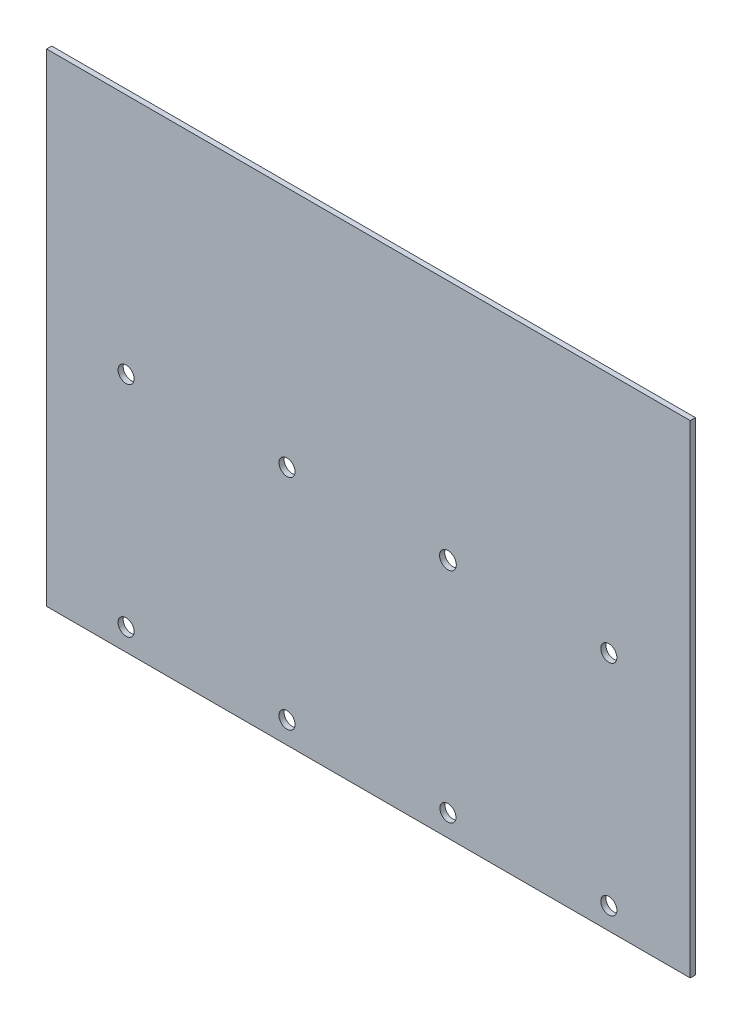
ISO-10303-21;
HEADER;
FILE_DESCRIPTION(('STEP AP214'),'2;1');
FILE_NAME('part.step','',(''),(''),'','','');
FILE_SCHEMA(('AUTOMOTIVE_DESIGN { 1 0 10303 214 1 1 1 1 }'));
ENDSEC;
DATA;
#1=APPLICATION_CONTEXT('core data for automotive mechanical design processes');
#2=APPLICATION_PROTOCOL_DEFINITION('international standard','automotive_design',2000,#1);
#3=PRODUCT_CONTEXT('',#1,'mechanical');
#4=PRODUCT('Part','Part','',(#3));
#5=PRODUCT_RELATED_PRODUCT_CATEGORY('part','',(#4));
#6=PRODUCT_DEFINITION_FORMATION('','',#4);
#7=PRODUCT_DEFINITION_CONTEXT('part definition',#1,'design');
#8=PRODUCT_DEFINITION('design','',#6,#7);
#9=PRODUCT_DEFINITION_SHAPE('','',#8);
#10=(LENGTH_UNIT() NAMED_UNIT(*) SI_UNIT(.MILLI.,.METRE.));
#11=(NAMED_UNIT(*) PLANE_ANGLE_UNIT() SI_UNIT($,.RADIAN.));
#12=(NAMED_UNIT(*) SI_UNIT($,.STERADIAN.) SOLID_ANGLE_UNIT());
#13=UNCERTAINTY_MEASURE_WITH_UNIT(LENGTH_MEASURE(1.E-05),#10,'distance_accuracy_value','');
#14=(GEOMETRIC_REPRESENTATION_CONTEXT(3) GLOBAL_UNCERTAINTY_ASSIGNED_CONTEXT((#13)) GLOBAL_UNIT_ASSIGNED_CONTEXT((#10,
#11,#12)) REPRESENTATION_CONTEXT('',''));
#15=CARTESIAN_POINT('',(0.,0.,0.));
#16=DIRECTION('',(0.,0.,1.));
#17=DIRECTION('',(1.,0.,0.));
#18=AXIS2_PLACEMENT_3D('',#15,#16,#17);
#19=CARTESIAN_POINT('',(100.,-75.,1.6));
#20=DIRECTION('',(-1.,0.,0.));
#21=DIRECTION('',(0.,0.,1.));
#22=AXIS2_PLACEMENT_3D('',#19,#20,#21);
#23=PLANE('',#22);
#24=DIRECTION('',(0.,1.,0.));
#25=VECTOR('',#24,1.);
#26=CARTESIAN_POINT('',(100.,-75.,0.));
#27=LINE('',#26,#25);
#28=CARTESIAN_POINT('',(100.,-75.,0.));
#29=VERTEX_POINT('',#28);
#30=CARTESIAN_POINT('',(100.,75.,0.));
#31=VERTEX_POINT('',#30);
#32=EDGE_CURVE('E96',#29,#31,#27,.T.);
#33=ORIENTED_EDGE('',*,*,#32,.T.);
#34=DIRECTION('',(0.,0.,-1.));
#35=VECTOR('',#34,1.);
#36=CARTESIAN_POINT('',(100.,75.,1.6));
#37=LINE('',#36,#35);
#38=CARTESIAN_POINT('',(100.,75.,1.6));
#39=VERTEX_POINT('',#38);
#40=EDGE_CURVE('E11',#39,#31,#37,.T.);
#41=ORIENTED_EDGE('',*,*,#40,.F.);
#42=DIRECTION('',(0.,1.,0.));
#43=VECTOR('',#42,1.);
#44=CARTESIAN_POINT('',(100.,-75.,1.6));
#45=LINE('',#44,#43);
#46=CARTESIAN_POINT('',(100.,-75.,1.6));
#47=VERTEX_POINT('',#46);
#48=EDGE_CURVE('E84',#47,#39,#45,.T.);
#49=ORIENTED_EDGE('',*,*,#48,.F.);
#50=DIRECTION('',(0.,0.,-1.));
#51=VECTOR('',#50,1.);
#52=CARTESIAN_POINT('',(100.,-75.,1.6));
#53=LINE('',#52,#51);
#54=EDGE_CURVE('E92',#47,#29,#53,.T.);
#55=ORIENTED_EDGE('',*,*,#54,.T.);
#56=EDGE_LOOP('',(#33,#41,#49,#55));
#57=FACE_BOUND('',#56,.T.);
#58=ADVANCED_FACE('F33',(#57),#23,.F.);
#59=CARTESIAN_POINT('',(-100.,75.,1.6));
#60=DIRECTION('',(0.,-1.,0.));
#61=DIRECTION('',(0.,0.,-1.));
#62=AXIS2_PLACEMENT_3D('',#59,#60,#61);
#63=PLANE('',#62);
#64=DIRECTION('',(-1.,0.,0.));
#65=VECTOR('',#64,1.);
#66=CARTESIAN_POINT('',(-100.,75.,0.));
#67=LINE('',#66,#65);
#68=CARTESIAN_POINT('',(-100.,75.,0.));
#69=VERTEX_POINT('',#68);
#70=EDGE_CURVE('E88',#31,#69,#67,.T.);
#71=ORIENTED_EDGE('',*,*,#70,.T.);
#72=DIRECTION('',(0.,0.,-1.));
#73=VECTOR('',#72,1.);
#74=CARTESIAN_POINT('',(-100.,75.,1.6));
#75=LINE('',#74,#73);
#76=CARTESIAN_POINT('',(-100.,75.,1.6));
#77=VERTEX_POINT('',#76);
#78=EDGE_CURVE('E41',#77,#69,#75,.T.);
#79=ORIENTED_EDGE('',*,*,#78,.F.);
#80=DIRECTION('',(-1.,0.,0.));
#81=VECTOR('',#80,1.);
#82=CARTESIAN_POINT('',(-100.,75.,1.6));
#83=LINE('',#82,#81);
#84=EDGE_CURVE('E79',#39,#77,#83,.T.);
#85=ORIENTED_EDGE('',*,*,#84,.F.);
#86=ORIENTED_EDGE('',*,*,#40,.T.);
#87=EDGE_LOOP('',(#71,#79,#85,#86));
#88=FACE_BOUND('',#87,.T.);
#89=ADVANCED_FACE('F87',(#88),#63,.F.);
#90=CARTESIAN_POINT('',(-100.,-75.,1.6));
#91=DIRECTION('',(1.,0.,0.));
#92=DIRECTION('',(0.,0.,-1.));
#93=AXIS2_PLACEMENT_3D('',#90,#91,#92);
#94=PLANE('',#93);
#95=DIRECTION('',(0.,-1.,0.));
#96=VECTOR('',#95,1.);
#97=CARTESIAN_POINT('',(-100.,-75.,0.));
#98=LINE('',#97,#96);
#99=CARTESIAN_POINT('',(-100.,-75.,0.));
#100=VERTEX_POINT('',#99);
#101=EDGE_CURVE('E66',#69,#100,#98,.T.);
#102=ORIENTED_EDGE('',*,*,#101,.T.);
#103=DIRECTION('',(0.,0.,-1.));
#104=VECTOR('',#103,1.);
#105=CARTESIAN_POINT('',(-100.,-75.,1.6));
#106=LINE('',#105,#104);
#107=CARTESIAN_POINT('',(-100.,-75.,1.6));
#108=VERTEX_POINT('',#107);
#109=EDGE_CURVE('E89',#108,#100,#106,.T.);
#110=ORIENTED_EDGE('',*,*,#109,.F.);
#111=DIRECTION('',(0.,-1.,0.));
#112=VECTOR('',#111,1.);
#113=CARTESIAN_POINT('',(-100.,-75.,1.6));
#114=LINE('',#113,#112);
#115=EDGE_CURVE('E82',#77,#108,#114,.T.);
#116=ORIENTED_EDGE('',*,*,#115,.F.);
#117=ORIENTED_EDGE('',*,*,#78,.T.);
#118=EDGE_LOOP('',(#102,#110,#116,#117));
#119=FACE_BOUND('',#118,.T.);
#120=ADVANCED_FACE('F90',(#119),#94,.F.);
#121=CARTESIAN_POINT('',(-100.,-75.,1.6));
#122=DIRECTION('',(0.,1.,0.));
#123=DIRECTION('',(0.,0.,1.));
#124=AXIS2_PLACEMENT_3D('',#121,#122,#123);
#125=PLANE('',#124);
#126=DIRECTION('',(1.,0.,0.));
#127=VECTOR('',#126,1.);
#128=CARTESIAN_POINT('',(-100.,-75.,0.));
#129=LINE('',#128,#127);
#130=EDGE_CURVE('E72',#100,#29,#129,.T.);
#131=ORIENTED_EDGE('',*,*,#130,.T.);
#132=ORIENTED_EDGE('',*,*,#54,.F.);
#133=DIRECTION('',(1.,0.,0.));
#134=VECTOR('',#133,1.);
#135=CARTESIAN_POINT('',(-100.,-75.,1.6));
#136=LINE('',#135,#134);
#137=EDGE_CURVE('E49',#108,#47,#136,.T.);
#138=ORIENTED_EDGE('',*,*,#137,.F.);
#139=ORIENTED_EDGE('',*,*,#109,.T.);
#140=EDGE_LOOP('',(#131,#132,#138,#139));
#141=FACE_BOUND('',#140,.T.);
#142=ADVANCED_FACE('F104',(#141),#125,.F.);
#143=CARTESIAN_POINT('',(0.,0.,1.6));
#144=DIRECTION('',(0.,0.,-1.));
#145=DIRECTION('',(-1.,0.,0.));
#146=AXIS2_PLACEMENT_3D('',#143,#144,#145);
#147=PLANE('',#146);
#148=CARTESIAN_POINT('',(-75.3,-68.1966478339554,1.6));
#149=DIRECTION('',(0.,0.,-1.));
#150=DIRECTION('',(-1.,0.,0.));
#151=AXIS2_PLACEMENT_3D('',#148,#149,#150);
#152=CIRCLE('',#151,2.50000000000001);
#153=CARTESIAN_POINT('',(-77.8,-68.1966478339554,1.6));
#154=VERTEX_POINT('',#153);
#155=EDGE_CURVE('E99',#154,#154,#152,.T.);
#156=ORIENTED_EDGE('',*,*,#155,.T.);
#157=EDGE_LOOP('',(#156));
#158=FACE_BOUND('',#157,.T.);
#159=CARTESIAN_POINT('',(74.7,-0.196647833955309,1.6));
#160=DIRECTION('',(0.,0.,-1.));
#161=DIRECTION('',(-1.,0.,0.));
#162=AXIS2_PLACEMENT_3D('',#159,#160,#161);
#163=CIRCLE('',#162,2.50000000000001);
#164=CARTESIAN_POINT('',(72.2,-0.196647833955309,1.6));
#165=VERTEX_POINT('',#164);
#166=EDGE_CURVE('E112',#165,#165,#163,.T.);
#167=ORIENTED_EDGE('',*,*,#166,.T.);
#168=EDGE_LOOP('',(#167));
#169=FACE_BOUND('',#168,.T.);
#170=CARTESIAN_POINT('',(24.7,-0.196647833955323,1.6));
#171=DIRECTION('',(0.,0.,-1.));
#172=DIRECTION('',(-1.,0.,0.));
#173=AXIS2_PLACEMENT_3D('',#170,#171,#172);
#174=CIRCLE('',#173,2.6);
#175=CARTESIAN_POINT('',(22.1,-0.196647833955323,1.6));
#176=VERTEX_POINT('',#175);
#177=EDGE_CURVE('E115',#176,#176,#174,.T.);
#178=ORIENTED_EDGE('',*,*,#177,.T.);
#179=EDGE_LOOP('',(#178));
#180=FACE_BOUND('',#179,.T.);
#181=CARTESIAN_POINT('',(-25.3,-0.196647833955337,1.6));
#182=DIRECTION('',(0.,0.,-1.));
#183=DIRECTION('',(-1.,0.,0.));
#184=AXIS2_PLACEMENT_3D('',#181,#182,#183);
#185=CIRCLE('',#184,2.5);
#186=CARTESIAN_POINT('',(-27.8,-0.196647833955337,1.6));
#187=VERTEX_POINT('',#186);
#188=EDGE_CURVE('E118',#187,#187,#185,.T.);
#189=ORIENTED_EDGE('',*,*,#188,.T.);
#190=EDGE_LOOP('',(#189));
#191=FACE_BOUND('',#190,.T.);
#192=CARTESIAN_POINT('',(-25.3,-68.1966478339554,1.6));
#193=DIRECTION('',(0.,0.,-1.));
#194=DIRECTION('',(-1.,0.,0.));
#195=AXIS2_PLACEMENT_3D('',#192,#193,#194);
#196=CIRCLE('',#195,2.5);
#197=CARTESIAN_POINT('',(-27.8,-68.1966478339554,1.6));
#198=VERTEX_POINT('',#197);
#199=EDGE_CURVE('E121',#198,#198,#196,.T.);
#200=ORIENTED_EDGE('',*,*,#199,.T.);
#201=EDGE_LOOP('',(#200));
#202=FACE_BOUND('',#201,.T.);
#203=CARTESIAN_POINT('',(24.7,-68.1966478339554,1.6));
#204=DIRECTION('',(0.,0.,-1.));
#205=DIRECTION('',(-1.,0.,0.));
#206=AXIS2_PLACEMENT_3D('',#203,#204,#205);
#207=CIRCLE('',#206,2.5);
#208=CARTESIAN_POINT('',(22.2,-68.1966478339554,1.6));
#209=VERTEX_POINT('',#208);
#210=EDGE_CURVE('E124',#209,#209,#207,.T.);
#211=ORIENTED_EDGE('',*,*,#210,.T.);
#212=EDGE_LOOP('',(#211));
#213=FACE_BOUND('',#212,.T.);
#214=CARTESIAN_POINT('',(74.7,-68.1966478339554,1.6));
#215=DIRECTION('',(0.,0.,-1.));
#216=DIRECTION('',(-1.,0.,0.));
#217=AXIS2_PLACEMENT_3D('',#214,#215,#216);
#218=CIRCLE('',#217,2.50000000000001);
#219=CARTESIAN_POINT('',(72.2,-68.1966478339554,1.6));
#220=VERTEX_POINT('',#219);
#221=EDGE_CURVE('E127',#220,#220,#218,.T.);
#222=ORIENTED_EDGE('',*,*,#221,.T.);
#223=EDGE_LOOP('',(#222));
#224=FACE_BOUND('',#223,.T.);
#225=CARTESIAN_POINT('',(-75.3,-0.196647833955357,1.6));
#226=DIRECTION('',(0.,0.,-1.));
#227=DIRECTION('',(-1.,0.,0.));
#228=AXIS2_PLACEMENT_3D('',#225,#226,#227);
#229=CIRCLE('',#228,2.50000000000001);
#230=CARTESIAN_POINT('',(-77.8,-0.196647833955357,1.6));
#231=VERTEX_POINT('',#230);
#232=EDGE_CURVE('E130',#231,#231,#229,.T.);
#233=ORIENTED_EDGE('',*,*,#232,.T.);
#234=EDGE_LOOP('',(#233));
#235=FACE_BOUND('',#234,.T.);
#236=ORIENTED_EDGE('',*,*,#48,.T.);
#237=ORIENTED_EDGE('',*,*,#84,.T.);
#238=ORIENTED_EDGE('',*,*,#115,.T.);
#239=ORIENTED_EDGE('',*,*,#137,.T.);
#240=EDGE_LOOP('',(#236,#237,#238,#239));
#241=FACE_BOUND('',#240,.T.);
#242=ADVANCED_FACE('F80',(#158,#169,#180,#191,#202,#213,#224,#235,#241),#147,.F.);
#243=CARTESIAN_POINT('',(0.,0.,0.));
#244=DIRECTION('',(0.,0.,-1.));
#245=DIRECTION('',(-1.,0.,0.));
#246=AXIS2_PLACEMENT_3D('',#243,#244,#245);
#247=PLANE('',#246);
#248=CARTESIAN_POINT('',(-75.3,-68.1966478339554,0.));
#249=DIRECTION('',(0.,0.,-1.));
#250=DIRECTION('',(-1.,0.,0.));
#251=AXIS2_PLACEMENT_3D('',#248,#249,#250);
#252=CIRCLE('',#251,2.50000000000001);
#253=CARTESIAN_POINT('',(-77.8,-68.1966478339554,0.));
#254=VERTEX_POINT('',#253);
#255=EDGE_CURVE('E143',#254,#254,#252,.T.);
#256=ORIENTED_EDGE('',*,*,#255,.F.);
#257=EDGE_LOOP('',(#256));
#258=FACE_BOUND('',#257,.T.);
#259=CARTESIAN_POINT('',(74.7,-0.196647833955309,0.));
#260=DIRECTION('',(0.,0.,-1.));
#261=DIRECTION('',(-1.,0.,0.));
#262=AXIS2_PLACEMENT_3D('',#259,#260,#261);
#263=CIRCLE('',#262,2.50000000000001);
#264=CARTESIAN_POINT('',(72.2,-0.196647833955309,0.));
#265=VERTEX_POINT('',#264);
#266=EDGE_CURVE('E140',#265,#265,#263,.T.);
#267=ORIENTED_EDGE('',*,*,#266,.F.);
#268=EDGE_LOOP('',(#267));
#269=FACE_BOUND('',#268,.T.);
#270=CARTESIAN_POINT('',(24.7,-0.196647833955323,0.));
#271=DIRECTION('',(0.,0.,-1.));
#272=DIRECTION('',(-1.,0.,0.));
#273=AXIS2_PLACEMENT_3D('',#270,#271,#272);
#274=CIRCLE('',#273,2.6);
#275=CARTESIAN_POINT('',(22.1,-0.196647833955323,0.));
#276=VERTEX_POINT('',#275);
#277=EDGE_CURVE('E137',#276,#276,#274,.T.);
#278=ORIENTED_EDGE('',*,*,#277,.F.);
#279=EDGE_LOOP('',(#278));
#280=FACE_BOUND('',#279,.T.);
#281=CARTESIAN_POINT('',(-25.3,-0.196647833955337,0.));
#282=DIRECTION('',(0.,0.,-1.));
#283=DIRECTION('',(-1.,0.,0.));
#284=AXIS2_PLACEMENT_3D('',#281,#282,#283);
#285=CIRCLE('',#284,2.5);
#286=CARTESIAN_POINT('',(-27.8,-0.196647833955337,0.));
#287=VERTEX_POINT('',#286);
#288=EDGE_CURVE('E136',#287,#287,#285,.T.);
#289=ORIENTED_EDGE('',*,*,#288,.F.);
#290=EDGE_LOOP('',(#289));
#291=FACE_BOUND('',#290,.T.);
#292=CARTESIAN_POINT('',(-25.3,-68.1966478339554,0.));
#293=DIRECTION('',(0.,0.,-1.));
#294=DIRECTION('',(-1.,0.,0.));
#295=AXIS2_PLACEMENT_3D('',#292,#293,#294);
#296=CIRCLE('',#295,2.5);
#297=CARTESIAN_POINT('',(-27.8,-68.1966478339554,0.));
#298=VERTEX_POINT('',#297);
#299=EDGE_CURVE('E146',#298,#298,#296,.T.);
#300=ORIENTED_EDGE('',*,*,#299,.F.);
#301=EDGE_LOOP('',(#300));
#302=FACE_BOUND('',#301,.T.);
#303=CARTESIAN_POINT('',(24.7,-68.1966478339554,0.));
#304=DIRECTION('',(0.,0.,-1.));
#305=DIRECTION('',(-1.,0.,0.));
#306=AXIS2_PLACEMENT_3D('',#303,#304,#305);
#307=CIRCLE('',#306,2.5);
#308=CARTESIAN_POINT('',(22.2,-68.1966478339554,0.));
#309=VERTEX_POINT('',#308);
#310=EDGE_CURVE('E152',#309,#309,#307,.T.);
#311=ORIENTED_EDGE('',*,*,#310,.F.);
#312=EDGE_LOOP('',(#311));
#313=FACE_BOUND('',#312,.T.);
#314=CARTESIAN_POINT('',(74.7,-68.1966478339554,0.));
#315=DIRECTION('',(0.,0.,-1.));
#316=DIRECTION('',(-1.,0.,0.));
#317=AXIS2_PLACEMENT_3D('',#314,#315,#316);
#318=CIRCLE('',#317,2.50000000000001);
#319=CARTESIAN_POINT('',(72.2,-68.1966478339554,0.));
#320=VERTEX_POINT('',#319);
#321=EDGE_CURVE('E149',#320,#320,#318,.T.);
#322=ORIENTED_EDGE('',*,*,#321,.F.);
#323=EDGE_LOOP('',(#322));
#324=FACE_BOUND('',#323,.T.);
#325=CARTESIAN_POINT('',(-75.3,-0.196647833955357,0.));
#326=DIRECTION('',(0.,0.,-1.));
#327=DIRECTION('',(-1.,0.,0.));
#328=AXIS2_PLACEMENT_3D('',#325,#326,#327);
#329=CIRCLE('',#328,2.50000000000001);
#330=CARTESIAN_POINT('',(-77.8,-0.196647833955357,0.));
#331=VERTEX_POINT('',#330);
#332=EDGE_CURVE('E133',#331,#331,#329,.T.);
#333=ORIENTED_EDGE('',*,*,#332,.F.);
#334=EDGE_LOOP('',(#333));
#335=FACE_BOUND('',#334,.T.);
#336=ORIENTED_EDGE('',*,*,#32,.F.);
#337=ORIENTED_EDGE('',*,*,#130,.F.);
#338=ORIENTED_EDGE('',*,*,#101,.F.);
#339=ORIENTED_EDGE('',*,*,#70,.F.);
#340=EDGE_LOOP('',(#336,#337,#338,#339));
#341=FACE_BOUND('',#340,.T.);
#342=ADVANCED_FACE('F107',(#258,#269,#280,#291,#302,#313,#324,#335,#341),#247,.T.);
#343=CARTESIAN_POINT('',(-75.3,-0.196647833955357,10.));
#344=DIRECTION('',(0.,0.,-1.));
#345=DIRECTION('',(-1.,0.,0.));
#346=AXIS2_PLACEMENT_3D('',#343,#344,#345);
#347=CYLINDRICAL_SURFACE('',#346,2.50000000000001);
#348=ORIENTED_EDGE('',*,*,#332,.T.);
#349=EDGE_LOOP('',(#348));
#350=FACE_BOUND('',#349,.T.);
#351=ORIENTED_EDGE('',*,*,#232,.F.);
#352=EDGE_LOOP('',(#351));
#353=FACE_BOUND('',#352,.T.);
#354=ADVANCED_FACE('F163',(#350,#353),#347,.F.);
#355=CARTESIAN_POINT('',(74.7,-68.1966478339554,10.));
#356=DIRECTION('',(0.,0.,-1.));
#357=DIRECTION('',(-1.,0.,0.));
#358=AXIS2_PLACEMENT_3D('',#355,#356,#357);
#359=CYLINDRICAL_SURFACE('',#358,2.50000000000001);
#360=ORIENTED_EDGE('',*,*,#321,.T.);
#361=EDGE_LOOP('',(#360));
#362=FACE_BOUND('',#361,.T.);
#363=ORIENTED_EDGE('',*,*,#221,.F.);
#364=EDGE_LOOP('',(#363));
#365=FACE_BOUND('',#364,.T.);
#366=ADVANCED_FACE('F174',(#362,#365),#359,.F.);
#367=CARTESIAN_POINT('',(24.7,-68.1966478339554,10.));
#368=DIRECTION('',(0.,0.,-1.));
#369=DIRECTION('',(-1.,0.,0.));
#370=AXIS2_PLACEMENT_3D('',#367,#368,#369);
#371=CYLINDRICAL_SURFACE('',#370,2.5);
#372=ORIENTED_EDGE('',*,*,#310,.T.);
#373=EDGE_LOOP('',(#372));
#374=FACE_BOUND('',#373,.T.);
#375=ORIENTED_EDGE('',*,*,#210,.F.);
#376=EDGE_LOOP('',(#375));
#377=FACE_BOUND('',#376,.T.);
#378=ADVANCED_FACE('F220',(#374,#377),#371,.F.);
#379=CARTESIAN_POINT('',(-25.3,-68.1966478339554,10.));
#380=DIRECTION('',(0.,0.,-1.));
#381=DIRECTION('',(-1.,0.,0.));
#382=AXIS2_PLACEMENT_3D('',#379,#380,#381);
#383=CYLINDRICAL_SURFACE('',#382,2.5);
#384=ORIENTED_EDGE('',*,*,#299,.T.);
#385=EDGE_LOOP('',(#384));
#386=FACE_BOUND('',#385,.T.);
#387=ORIENTED_EDGE('',*,*,#199,.F.);
#388=EDGE_LOOP('',(#387));
#389=FACE_BOUND('',#388,.T.);
#390=ADVANCED_FACE('F158',(#386,#389),#383,.F.);
#391=CARTESIAN_POINT('',(-25.3,-0.196647833955337,10.));
#392=DIRECTION('',(0.,0.,-1.));
#393=DIRECTION('',(-1.,0.,0.));
#394=AXIS2_PLACEMENT_3D('',#391,#392,#393);
#395=CYLINDRICAL_SURFACE('',#394,2.5);
#396=ORIENTED_EDGE('',*,*,#288,.T.);
#397=EDGE_LOOP('',(#396));
#398=FACE_BOUND('',#397,.T.);
#399=ORIENTED_EDGE('',*,*,#188,.F.);
#400=EDGE_LOOP('',(#399));
#401=FACE_BOUND('',#400,.T.);
#402=ADVANCED_FACE('F235',(#398,#401),#395,.F.);
#403=CARTESIAN_POINT('',(24.7,-0.196647833955323,10.));
#404=DIRECTION('',(0.,0.,-1.));
#405=DIRECTION('',(-1.,0.,0.));
#406=AXIS2_PLACEMENT_3D('',#403,#404,#405);
#407=CYLINDRICAL_SURFACE('',#406,2.6);
#408=ORIENTED_EDGE('',*,*,#277,.T.);
#409=EDGE_LOOP('',(#408));
#410=FACE_BOUND('',#409,.T.);
#411=ORIENTED_EDGE('',*,*,#177,.F.);
#412=EDGE_LOOP('',(#411));
#413=FACE_BOUND('',#412,.T.);
#414=ADVANCED_FACE('F242',(#410,#413),#407,.F.);
#415=CARTESIAN_POINT('',(74.7,-0.196647833955309,10.));
#416=DIRECTION('',(0.,0.,-1.));
#417=DIRECTION('',(-1.,0.,0.));
#418=AXIS2_PLACEMENT_3D('',#415,#416,#417);
#419=CYLINDRICAL_SURFACE('',#418,2.50000000000001);
#420=ORIENTED_EDGE('',*,*,#266,.T.);
#421=EDGE_LOOP('',(#420));
#422=FACE_BOUND('',#421,.T.);
#423=ORIENTED_EDGE('',*,*,#166,.F.);
#424=EDGE_LOOP('',(#423));
#425=FACE_BOUND('',#424,.T.);
#426=ADVANCED_FACE('F250',(#422,#425),#419,.F.);
#427=CARTESIAN_POINT('',(-75.3,-68.1966478339554,10.));
#428=DIRECTION('',(0.,0.,-1.));
#429=DIRECTION('',(-1.,0.,0.));
#430=AXIS2_PLACEMENT_3D('',#427,#428,#429);
#431=CYLINDRICAL_SURFACE('',#430,2.50000000000001);
#432=ORIENTED_EDGE('',*,*,#255,.T.);
#433=EDGE_LOOP('',(#432));
#434=FACE_BOUND('',#433,.T.);
#435=ORIENTED_EDGE('',*,*,#155,.F.);
#436=EDGE_LOOP('',(#435));
#437=FACE_BOUND('',#436,.T.);
#438=ADVANCED_FACE('F258',(#434,#437),#431,.F.);
#439=CLOSED_SHELL('',(#58,#89,#120,#142,#242,#342,#354,#366,#378,#390,#402,#414,#426,#438));
#440=MANIFOLD_SOLID_BREP('B2',#439);
#441=ADVANCED_BREP_SHAPE_REPRESENTATION('',(#18,#440),#14);
#442=SHAPE_DEFINITION_REPRESENTATION(#9,#441);
ENDSEC;
END-ISO-10303-21;
